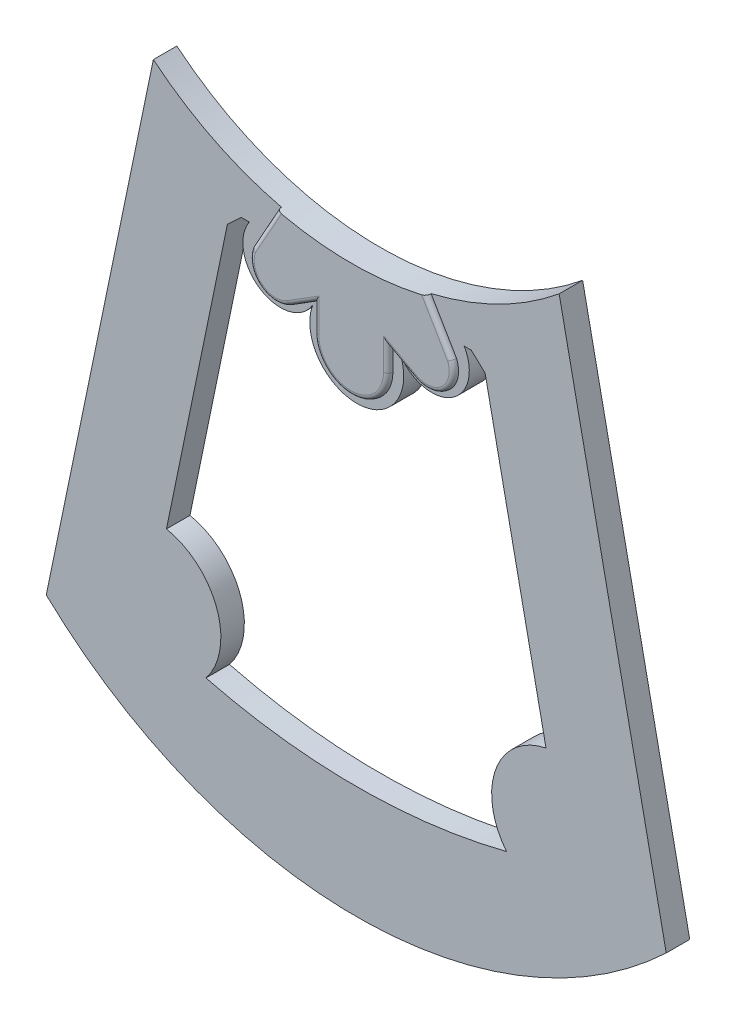
ISO-10303-21;
HEADER;
FILE_DESCRIPTION(('STEP AP214'),'2;1');
FILE_NAME('part.step','',(''),(''),'','','');
FILE_SCHEMA(('AUTOMOTIVE_DESIGN { 1 0 10303 214 1 1 1 1 }'));
ENDSEC;
DATA;
#1=APPLICATION_CONTEXT('core data for automotive mechanical design processes');
#2=APPLICATION_PROTOCOL_DEFINITION('international standard','automotive_design',2000,#1);
#3=PRODUCT_CONTEXT('',#1,'mechanical');
#4=PRODUCT('Part','Part','',(#3));
#5=PRODUCT_RELATED_PRODUCT_CATEGORY('part','',(#4));
#6=PRODUCT_DEFINITION_FORMATION('','',#4);
#7=PRODUCT_DEFINITION_CONTEXT('part definition',#1,'design');
#8=PRODUCT_DEFINITION('design','',#6,#7);
#9=PRODUCT_DEFINITION_SHAPE('','',#8);
#10=(LENGTH_UNIT() NAMED_UNIT(*) SI_UNIT(.MILLI.,.METRE.));
#11=(NAMED_UNIT(*) PLANE_ANGLE_UNIT() SI_UNIT($,.RADIAN.));
#12=(NAMED_UNIT(*) SI_UNIT($,.STERADIAN.) SOLID_ANGLE_UNIT());
#13=UNCERTAINTY_MEASURE_WITH_UNIT(LENGTH_MEASURE(1.E-05),#10,'distance_accuracy_value','');
#14=(GEOMETRIC_REPRESENTATION_CONTEXT(3) GLOBAL_UNCERTAINTY_ASSIGNED_CONTEXT((#13)) GLOBAL_UNIT_ASSIGNED_CONTEXT((#10,
#11,#12)) REPRESENTATION_CONTEXT('',''));
#15=CARTESIAN_POINT('',(0.,0.,0.));
#16=DIRECTION('',(0.,0.,1.));
#17=DIRECTION('',(1.,0.,0.));
#18=AXIS2_PLACEMENT_3D('',#15,#16,#17);
#19=CARTESIAN_POINT('',(65.88125,143.500383662868,0.));
#20=DIRECTION('',(0.,1.,0.));
#21=DIRECTION('',(0.,0.,1.));
#22=AXIS2_PLACEMENT_3D('',#19,#20,#21);
#23=PLANE('',#22);
#24=DIRECTION('',(-1.,0.,0.));
#25=VECTOR('',#24,1.);
#26=CARTESIAN_POINT('',(65.88125,143.500383662868,0.));
#27=LINE('',#26,#25);
#28=CARTESIAN_POINT('',(68.6118408671896,143.500383662868,0.));
#29=VERTEX_POINT('',#28);
#30=CARTESIAN_POINT('',(65.88125,143.500383662868,0.));
#31=VERTEX_POINT('',#30);
#32=EDGE_CURVE('E441',#29,#31,#27,.T.);
#33=ORIENTED_EDGE('',*,*,#32,.F.);
#34=DIRECTION('',(0.,0.,1.));
#35=VECTOR('',#34,1.);
#36=CARTESIAN_POINT('',(68.6118408671896,143.500383662868,0.));
#37=LINE('',#36,#35);
#38=CARTESIAN_POINT('',(68.6118408671896,143.500383662868,7.9375));
#39=VERTEX_POINT('',#38);
#40=EDGE_CURVE('E418',#29,#39,#37,.T.);
#41=ORIENTED_EDGE('',*,*,#40,.T.);
#42=DIRECTION('',(-1.,0.,0.));
#43=VECTOR('',#42,1.);
#44=CARTESIAN_POINT('',(65.88125,143.500383662868,7.9375));
#45=LINE('',#44,#43);
#46=CARTESIAN_POINT('',(65.88125,143.500383662868,7.9375));
#47=VERTEX_POINT('',#46);
#48=EDGE_CURVE('E465',#39,#47,#45,.T.);
#49=ORIENTED_EDGE('',*,*,#48,.T.);
#50=DIRECTION('',(0.,0.,1.));
#51=VECTOR('',#50,1.);
#52=CARTESIAN_POINT('',(65.88125,143.500383662868,0.));
#53=LINE('',#52,#51);
#54=EDGE_CURVE('E474',#31,#47,#53,.T.);
#55=ORIENTED_EDGE('',*,*,#54,.F.);
#56=EDGE_LOOP('',(#33,#41,#49,#55));
#57=FACE_BOUND('',#56,.T.);
#58=ADVANCED_FACE('F32',(#57),#23,.F.);
#59=CARTESIAN_POINT('',(104.775,110.670499117877,7.9375));
#60=DIRECTION('',(0.,0.,-1.));
#61=DIRECTION('',(-1.,0.,0.));
#62=AXIS2_PLACEMENT_3D('',#59,#60,#61);
#63=CYLINDRICAL_SURFACE('',#62,152.4);
#64=CARTESIAN_POINT('',(104.775,110.670499117877,0.));
#65=DIRECTION('',(0.,0.,1.));
#66=DIRECTION('',(1.,0.,0.));
#67=AXIS2_PLACEMENT_3D('',#64,#65,#66);
#68=CIRCLE('',#67,152.4);
#69=CARTESIAN_POINT('',(0.,0.,0.));
#70=VERTEX_POINT('',#69);
#71=CARTESIAN_POINT('',(209.55,0.,0.));
#72=VERTEX_POINT('',#71);
#73=EDGE_CURVE('E327',#70,#72,#68,.T.);
#74=ORIENTED_EDGE('',*,*,#73,.T.);
#75=DIRECTION('',(0.,0.,-1.));
#76=VECTOR('',#75,1.);
#77=CARTESIAN_POINT('',(209.55,0.,7.9375));
#78=LINE('',#77,#76);
#79=CARTESIAN_POINT('',(209.55,0.,7.9375));
#80=VERTEX_POINT('',#79);
#81=EDGE_CURVE('E330',#80,#72,#78,.T.);
#82=ORIENTED_EDGE('',*,*,#81,.F.);
#83=CARTESIAN_POINT('',(104.775,110.670499117877,7.9375));
#84=DIRECTION('',(0.,0.,1.));
#85=DIRECTION('',(1.,0.,0.));
#86=AXIS2_PLACEMENT_3D('',#83,#84,#85);
#87=CIRCLE('',#86,152.4);
#88=CARTESIAN_POINT('',(0.,0.,7.9375));
#89=VERTEX_POINT('',#88);
#90=EDGE_CURVE('E349',#89,#80,#87,.T.);
#91=ORIENTED_EDGE('',*,*,#90,.F.);
#92=DIRECTION('',(0.,0.,-1.));
#93=VECTOR('',#92,1.);
#94=CARTESIAN_POINT('',(0.,0.,7.9375));
#95=LINE('',#94,#93);
#96=EDGE_CURVE('E332',#89,#70,#95,.T.);
#97=ORIENTED_EDGE('',*,*,#96,.T.);
#98=EDGE_LOOP('',(#74,#82,#91,#97));
#99=FACE_BOUND('',#98,.T.);
#100=ADVANCED_FACE('F313',(#99),#63,.T.);
#101=CARTESIAN_POINT('',(173.355,174.85511093188,7.9375));
#102=DIRECTION('',(-0.979240325107693,-0.202702702702703,0.));
#103=DIRECTION('',(0.202702702702703,-0.979240325107693,0.));
#104=AXIS2_PLACEMENT_3D('',#101,#102,#103);
#105=PLANE('',#104);
#106=DIRECTION('',(-0.202702702702703,0.979240325107693,0.));
#107=VECTOR('',#106,1.);
#108=CARTESIAN_POINT('',(173.355,174.85511093188,0.));
#109=LINE('',#108,#107);
#110=CARTESIAN_POINT('',(173.355,174.85511093188,0.));
#111=VERTEX_POINT('',#110);
#112=EDGE_CURVE('E335',#72,#111,#109,.T.);
#113=ORIENTED_EDGE('',*,*,#112,.T.);
#114=DIRECTION('',(0.,0.,-1.));
#115=VECTOR('',#114,1.);
#116=CARTESIAN_POINT('',(173.355,174.85511093188,7.9375));
#117=LINE('',#116,#115);
#118=CARTESIAN_POINT('',(173.355,174.85511093188,7.9375));
#119=VERTEX_POINT('',#118);
#120=EDGE_CURVE('E354',#119,#111,#117,.T.);
#121=ORIENTED_EDGE('',*,*,#120,.F.);
#122=DIRECTION('',(-0.202702702702703,0.979240325107693,0.));
#123=VECTOR('',#122,1.);
#124=CARTESIAN_POINT('',(173.355,174.85511093188,7.9375));
#125=LINE('',#124,#123);
#126=EDGE_CURVE('E489',#80,#119,#125,.T.);
#127=ORIENTED_EDGE('',*,*,#126,.F.);
#128=ORIENTED_EDGE('',*,*,#81,.T.);
#129=EDGE_LOOP('',(#113,#121,#127,#128));
#130=FACE_BOUND('',#129,.T.);
#131=ADVANCED_FACE('F308',(#130),#105,.F.);
#132=CARTESIAN_POINT('',(104.775,258.221687567843,7.9375));
#133=DIRECTION('',(0.,0.,-1.));
#134=DIRECTION('',(-1.,0.,0.));
#135=AXIS2_PLACEMENT_3D('',#132,#133,#134);
#136=CYLINDRICAL_SURFACE('',#135,107.95);
#137=CARTESIAN_POINT('',(104.775,258.221687567843,9.525));
#138=DIRECTION('',(0.,0.,-1.));
#139=DIRECTION('',(1.,0.,0.));
#140=AXIS2_PLACEMENT_3D('',#137,#138,#139);
#141=CIRCLE('',#140,107.95);
#142=CARTESIAN_POINT('',(128.464956033912,152.903177878847,9.525));
#143=VERTEX_POINT('',#142);
#144=CARTESIAN_POINT('',(81.0750113269593,152.905435085628,9.525));
#145=VERTEX_POINT('',#144);
#146=EDGE_CURVE('E372',#143,#145,#141,.T.);
#147=ORIENTED_EDGE('',*,*,#146,.F.);
#148=CARTESIAN_POINT('',(128.464956033912,152.903177878847,9.525));
#149=CARTESIAN_POINT('',(128.512257065107,152.913817418776,9.52499842899379));
#150=CARTESIAN_POINT('',(128.559529041124,152.924484303336,9.52298303885355));
#151=CARTESIAN_POINT('',(128.653734599847,152.945807796816,9.5149291707803));
#152=CARTESIAN_POINT('',(128.700668158561,152.956464404962,9.50889041041388));
#153=CARTESIAN_POINT('',(128.840519657881,152.988316576372,9.48474823848041));
#154=CARTESIAN_POINT('',(128.932499799481,153.009397046763,9.46061893336153));
#155=CARTESIAN_POINT('',(129.111174705765,153.050581564774,9.39673281551979));
#156=CARTESIAN_POINT('',(129.197863705447,153.070684542678,9.35695929665416));
#157=CARTESIAN_POINT('',(129.363191988118,153.109221536108,9.26266770863809));
#158=CARTESIAN_POINT('',(129.441836413642,153.127656616964,9.20815914116603));
#159=CARTESIAN_POINT('',(129.586603505975,153.161741668138,9.08731915775392));
#160=CARTESIAN_POINT('',(129.652997147604,153.177451280018,9.02132950817525));
#161=CARTESIAN_POINT('',(129.773442361471,153.206049577169,8.87833409866643));
#162=CARTESIAN_POINT('',(129.827492968767,153.218938041887,8.80132747822615));
#163=CARTESIAN_POINT('',(129.919140101257,153.240847182251,8.64220318473147));
#164=CARTESIAN_POINT('',(129.957360884264,153.250014238292,8.56046450633683));
#165=CARTESIAN_POINT('',(130.019273434084,153.264886050601,8.39141064751719));
#166=CARTESIAN_POINT('',(130.042983315317,153.270595123488,8.30410257059086));
#167=CARTESIAN_POINT('',(130.067288918528,153.276450961431,8.16957049019439));
#168=CARTESIAN_POINT('',(130.073517528922,153.27795245816,8.12335473190504));
#169=CARTESIAN_POINT('',(130.081823068316,153.279955092991,8.03060060811351));
#170=CARTESIAN_POINT('',(130.083906248096,153.280457737234,7.98406283467119));
#171=CARTESIAN_POINT('',(130.083904991818,153.280457214302,7.9375));
#172=B_SPLINE_CURVE_WITH_KNOTS('',3,(#148,#149,#150,#151,#152,#153,#154,#155,#156,#157,#158,
#159,#160,#161,#162,#163,#164,#165,#166,#167,#168,#169,#170,#171),.UNSPECIFIED.,.F.,.F.,(4,2,2,
2,2,2,2,2,2,2,2,4),(0.,0.145361710983565,0.290733627175156,0.581442908473752,0.872463478930361,
1.16329683488025,1.44661767370815,1.72996065416598,2.00071713318835,2.27113492519674,
2.41093579907413,2.55052571084334),.UNSPECIFIED.);
#173=CARTESIAN_POINT('',(130.083904991818,153.280457214302,7.9375));
#174=VERTEX_POINT('',#173);
#175=EDGE_CURVE('E11',#143,#174,#172,.T.);
#176=ORIENTED_EDGE('',*,*,#175,.T.);
#177=CARTESIAN_POINT('',(104.775,258.221687567843,7.9375));
#178=DIRECTION('',(0.,0.,-1.));
#179=DIRECTION('',(1.,0.,0.));
#180=AXIS2_PLACEMENT_3D('',#177,#178,#179);
#181=CIRCLE('',#180,107.95);
#182=EDGE_CURVE('E491',#119,#174,#181,.T.);
#183=ORIENTED_EDGE('',*,*,#182,.F.);
#184=ORIENTED_EDGE('',*,*,#120,.T.);
#185=CARTESIAN_POINT('',(104.775,258.221687567843,0.));
#186=DIRECTION('',(0.,0.,-1.));
#187=DIRECTION('',(1.,0.,0.));
#188=AXIS2_PLACEMENT_3D('',#185,#186,#187);
#189=CIRCLE('',#188,107.95);
#190=CARTESIAN_POINT('',(36.195,174.85511093188,0.));
#191=VERTEX_POINT('',#190);
#192=EDGE_CURVE('E338',#111,#191,#189,.T.);
#193=ORIENTED_EDGE('',*,*,#192,.T.);
#194=DIRECTION('',(0.,0.,-1.));
#195=VECTOR('',#194,1.);
#196=CARTESIAN_POINT('',(36.195,174.85511093188,7.9375));
#197=LINE('',#196,#195);
#198=CARTESIAN_POINT('',(36.195,174.85511093188,7.9375));
#199=VERTEX_POINT('',#198);
#200=EDGE_CURVE('E351',#199,#191,#197,.T.);
#201=ORIENTED_EDGE('',*,*,#200,.F.);
#202=CARTESIAN_POINT('',(79.4660950081821,153.280457214302,7.9375));
#203=VERTEX_POINT('',#202);
#204=EDGE_CURVE('E490',#203,#199,#181,.T.);
#205=ORIENTED_EDGE('',*,*,#204,.F.);
#206=CARTESIAN_POINT('',(79.4660950081821,153.280457214302,7.9375));
#207=CARTESIAN_POINT('',(79.4660945345376,153.280457487844,7.98094858047463));
#208=CARTESIAN_POINT('',(79.4678968005009,153.280022654825,8.02437593274889));
#209=CARTESIAN_POINT('',(79.4750816010233,153.278290208827,8.11091096082904));
#210=CARTESIAN_POINT('',(79.4804637102826,153.276992698339,8.15401867399428));
#211=CARTESIAN_POINT('',(79.5019049890907,153.27182621451,8.2822369784127));
#212=CARTESIAN_POINT('',(79.5232594191852,153.266683200799,8.36647406186022));
#213=CARTESIAN_POINT('',(79.5793799992276,153.253196798331,8.53003804359265));
#214=CARTESIAN_POINT('',(79.6141479714913,153.244852974724,8.60936427300649));
#215=CARTESIAN_POINT('',(79.6959665260973,153.225276472643,8.76102518444456));
#216=CARTESIAN_POINT('',(79.7430183768595,153.21404349584,8.83335914339694));
#217=CARTESIAN_POINT('',(79.8487481807475,153.188895266968,8.97022799977702));
#218=CARTESIAN_POINT('',(79.9075925598727,153.1749417064,9.03462707019403));
#219=CARTESIAN_POINT('',(80.0346821783632,153.144937374344,9.15278523021685));
#220=CARTESIAN_POINT('',(80.1029295682379,153.128886123148,9.20654187898131));
#221=CARTESIAN_POINT('',(80.249445070666,153.094595412971,9.30391254797651));
#222=CARTESIAN_POINT('',(80.3279817891721,153.076298728424,9.34710177055125));
#223=CARTESIAN_POINT('',(80.4908696789535,153.038559171059,9.41987404938997));
#224=CARTESIAN_POINT('',(80.5752208141407,153.019116305353,9.44945719009389));
#225=CARTESIAN_POINT('',(80.7288644684674,152.983906046077,9.48958945141232));
#226=CARTESIAN_POINT('',(80.7974855058794,152.968249370849,9.50286635589049));
#227=CARTESIAN_POINT('',(80.9357315101706,152.936850705773,9.52057180276624));
#228=CARTESIAN_POINT('',(81.0053548225333,152.921108878492,9.52501354577508));
#229=CARTESIAN_POINT('',(81.0750113269593,152.905435085628,9.525));
#230=B_SPLINE_CURVE_WITH_KNOTS('',3,(#206,#207,#208,#209,#210,#211,#212,#213,#214,#215,#216,
#217,#218,#219,#220,#221,#222,#223,#224,#225,#226,#227,#228,#229),.UNSPECIFIED.,.F.,.F.,(4,2,2,
2,2,2,2,2,2,2,2,4),(0.,0.130264260014154,0.260513046871119,0.520325625207415,0.780173513187151,
1.04004824339895,1.3038878594066,1.56778791715433,1.84099942904869,2.11420924535753,
2.32855099800317,2.54257226144784),.UNSPECIFIED.);
#231=EDGE_CURVE('E46',#203,#145,#230,.T.);
#232=ORIENTED_EDGE('',*,*,#231,.T.);
#233=EDGE_LOOP('',(#147,#176,#183,#184,#193,#201,#205,#232));
#234=FACE_BOUND('',#233,.T.);
#235=ADVANCED_FACE('F302',(#234),#136,.F.);
#236=CARTESIAN_POINT('',(0.,0.,7.9375));
#237=DIRECTION('',(0.979240325107693,-0.202702702702703,0.));
#238=DIRECTION('',(0.202702702702703,0.979240325107693,0.));
#239=AXIS2_PLACEMENT_3D('',#236,#237,#238);
#240=PLANE('',#239);
#241=DIRECTION('',(-0.202702702702703,-0.979240325107693,0.));
#242=VECTOR('',#241,1.);
#243=CARTESIAN_POINT('',(0.,0.,0.));
#244=LINE('',#243,#242);
#245=EDGE_CURVE('E347',#191,#70,#244,.T.);
#246=ORIENTED_EDGE('',*,*,#245,.T.);
#247=ORIENTED_EDGE('',*,*,#96,.F.);
#248=DIRECTION('',(-0.202702702702703,-0.979240325107693,0.));
#249=VECTOR('',#248,1.);
#250=CARTESIAN_POINT('',(0.,0.,7.9375));
#251=LINE('',#250,#249);
#252=EDGE_CURVE('E343',#199,#89,#251,.T.);
#253=ORIENTED_EDGE('',*,*,#252,.F.);
#254=ORIENTED_EDGE('',*,*,#200,.T.);
#255=EDGE_LOOP('',(#246,#247,#253,#254));
#256=FACE_BOUND('',#255,.T.);
#257=ADVANCED_FACE('F307',(#256),#240,.F.);
#258=CARTESIAN_POINT('',(104.775,110.670499117877,7.9375));
#259=DIRECTION('',(0.,0.,1.));
#260=DIRECTION('',(1.,0.,0.));
#261=AXIS2_PLACEMENT_3D('',#258,#259,#260);
#262=PLANE('',#261);
#263=DIRECTION('',(-0.505652147530801,0.862737448878562,0.));
#264=VECTOR('',#263,1.);
#265=CARTESIAN_POINT('',(138.657255170699,138.652713027336,7.9375));
#266=LINE('',#265,#264);
#267=CARTESIAN_POINT('',(138.657255170699,138.652713027336,7.9375));
#268=VERTEX_POINT('',#267);
#269=EDGE_CURVE('E376',#268,#174,#266,.T.);
#270=ORIENTED_EDGE('',*,*,#269,.F.);
#271=CARTESIAN_POINT('',(130.207247306887,135.141831850332,7.9375));
#272=DIRECTION('',(0.,0.,1.));
#273=DIRECTION('',(1.,0.,0.));
#274=AXIS2_PLACEMENT_3D('',#271,#272,#273);
#275=CIRCLE('',#274,9.15035078767626);
#276=CARTESIAN_POINT('',(125.809979084313,127.117309950788,7.9375));
#277=VERTEX_POINT('',#276);
#278=EDGE_CURVE('E382',#277,#268,#275,.T.);
#279=ORIENTED_EDGE('',*,*,#278,.F.);
#280=DIRECTION('',(0.876963308374144,-0.480557338686525,0.));
#281=VECTOR('',#280,1.);
#282=CARTESIAN_POINT('',(117.162311803682,131.856048658033,7.9375));
#283=LINE('',#282,#281);
#284=CARTESIAN_POINT('',(117.162311803682,131.856048658033,7.9375));
#285=VERTEX_POINT('',#284);
#286=EDGE_CURVE('E395',#285,#277,#283,.T.);
#287=ORIENTED_EDGE('',*,*,#286,.F.);
#288=DIRECTION('',(0.,1.,0.));
#289=VECTOR('',#288,1.);
#290=CARTESIAN_POINT('',(117.162311803682,123.836556770023,7.9375));
#291=LINE('',#290,#289);
#292=CARTESIAN_POINT('',(117.162311803682,123.836556770023,7.9375));
#293=VERTEX_POINT('',#292);
#294=EDGE_CURVE('E392',#293,#285,#291,.T.);
#295=ORIENTED_EDGE('',*,*,#294,.F.);
#296=CARTESIAN_POINT('',(104.636462236003,123.836556770023,7.9375));
#297=DIRECTION('',(0.,0.,1.));
#298=DIRECTION('',(1.,0.,0.));
#299=AXIS2_PLACEMENT_3D('',#296,#297,#298);
#300=CIRCLE('',#299,12.5258495676792);
#301=CARTESIAN_POINT('',(92.1106126683234,123.836556770023,7.9375));
#302=VERTEX_POINT('',#301);
#303=EDGE_CURVE('E389',#302,#293,#300,.T.);
#304=ORIENTED_EDGE('',*,*,#303,.F.);
#305=DIRECTION('',(0.,-1.,0.));
#306=VECTOR('',#305,1.);
#307=CARTESIAN_POINT('',(92.1106126683234,132.311409740972,7.9375));
#308=LINE('',#307,#306);
#309=CARTESIAN_POINT('',(92.1106126683234,132.311409740972,7.9375));
#310=VERTEX_POINT('',#309);
#311=EDGE_CURVE('E386',#310,#302,#308,.T.);
#312=ORIENTED_EDGE('',*,*,#311,.F.);
#313=DIRECTION('',(0.847754771245418,0.530388393378503,0.));
#314=VECTOR('',#313,1.);
#315=CARTESIAN_POINT('',(92.1106126683234,132.311409740972,7.9375));
#316=LINE('',#315,#314);
#317=CARTESIAN_POINT('',(83.8643676231442,127.152237761919,7.9375));
#318=VERTEX_POINT('',#317);
#319=EDGE_CURVE('E217',#318,#310,#316,.T.);
#320=ORIENTED_EDGE('',*,*,#319,.F.);
#321=CARTESIAN_POINT('',(79.151975634031,134.684364864667,7.9375));
#322=DIRECTION('',(0.,0.,1.));
#323=DIRECTION('',(-1.,0.,0.));
#324=AXIS2_PLACEMENT_3D('',#321,#322,#323);
#325=CIRCLE('',#324,8.88479470505741);
#326=CARTESIAN_POINT('',(70.8596017422812,137.874366775394,7.9375));
#327=VERTEX_POINT('',#326);
#328=EDGE_CURVE('E210',#327,#318,#325,.T.);
#329=ORIENTED_EDGE('',*,*,#328,.F.);
#330=DIRECTION('',(-0.487700765271342,-0.873010861074333,0.));
#331=VECTOR('',#330,1.);
#332=CARTESIAN_POINT('',(79.4660950081821,153.280457214302,7.9375));
#333=LINE('',#332,#331);
#334=EDGE_CURVE('E214',#203,#327,#333,.T.);
#335=ORIENTED_EDGE('',*,*,#334,.F.);
#336=ORIENTED_EDGE('',*,*,#204,.T.);
#337=ORIENTED_EDGE('',*,*,#252,.T.);
#338=ORIENTED_EDGE('',*,*,#90,.T.);
#339=ORIENTED_EDGE('',*,*,#126,.T.);
#340=ORIENTED_EDGE('',*,*,#182,.T.);
#341=EDGE_LOOP('',(#270,#279,#287,#295,#304,#312,#320,#329,#335,#336,#337,#338,#339,#340));
#342=FACE_BOUND('',#341,.T.);
#343=ORIENTED_EDGE('',*,*,#48,.F.);
#344=CARTESIAN_POINT('',(79.1561005992414,136.421641775849,7.9375));
#345=DIRECTION('',(0.,0.,1.));
#346=DIRECTION('',(1.,0.,0.));
#347=AXIS2_PLACEMENT_3D('',#344,#345,#346);
#348=CIRCLE('',#347,12.7);
#349=CARTESIAN_POINT('',(90.0089109745047,129.825695523902,7.9375));
#350=VERTEX_POINT('',#349);
#351=EDGE_CURVE('E404',#39,#350,#348,.T.);
#352=ORIENTED_EDGE('',*,*,#351,.T.);
#353=CARTESIAN_POINT('',(104.946167998357,124.450383662868,7.9375));
#354=DIRECTION('',(0.,0.,1.));
#355=DIRECTION('',(1.,0.,0.));
#356=AXIS2_PLACEMENT_3D('',#353,#354,#355);
#357=CIRCLE('',#356,15.875);
#358=CARTESIAN_POINT('',(119.883425022209,129.825695523902,7.9375));
#359=VERTEX_POINT('',#358);
#360=EDGE_CURVE('E375',#350,#359,#357,.T.);
#361=ORIENTED_EDGE('',*,*,#360,.T.);
#362=CARTESIAN_POINT('',(130.283850707261,137.114120975926,7.9375));
#363=DIRECTION('',(0.,0.,1.));
#364=DIRECTION('',(1.,0.,0.));
#365=AXIS2_PLACEMENT_3D('',#362,#363,#364);
#366=CIRCLE('',#365,12.7);
#367=CARTESIAN_POINT('',(141.261357204339,143.500383662868,7.9375));
#368=VERTEX_POINT('',#367);
#369=EDGE_CURVE('E379',#359,#368,#366,.T.);
#370=ORIENTED_EDGE('',*,*,#369,.T.);
#371=CARTESIAN_POINT('',(143.66875,143.500383662868,7.9375));
#372=VERTEX_POINT('',#371);
#373=EDGE_CURVE('E466',#372,#368,#45,.T.);
#374=ORIENTED_EDGE('',*,*,#373,.F.);
#375=DIRECTION('',(-0.732119152889858,0.681176589418512,0.));
#376=VECTOR('',#375,1.);
#377=CARTESIAN_POINT('',(148.317706620851,139.17491232006,7.9375));
#378=LINE('',#377,#376);
#379=CARTESIAN_POINT('',(148.317706620851,139.17491232006,7.9375));
#380=VERTEX_POINT('',#379);
#381=EDGE_CURVE('E462',#380,#372,#378,.T.);
#382=ORIENTED_EDGE('',*,*,#381,.F.);
#383=DIRECTION('',(-0.202702702702703,0.979240325107693,0.));
#384=VECTOR('',#383,1.);
#385=CARTESIAN_POINT('',(168.912301215445,39.6840952891184,7.9375));
#386=LINE('',#385,#384);
#387=CARTESIAN_POINT('',(168.912301215445,39.6840952891184,7.9375));
#388=VERTEX_POINT('',#387);
#389=EDGE_CURVE('E459',#388,#380,#386,.T.);
#390=ORIENTED_EDGE('',*,*,#389,.F.);
#391=CARTESIAN_POINT('',(173.585130717299,17.110034758317,7.9375));
#392=DIRECTION('',(0.,0.,-1.));
#393=DIRECTION('',(-1.,0.,0.));
#394=AXIS2_PLACEMENT_3D('',#391,#392,#393);
#395=CIRCLE('',#394,23.0526255424774);
#396=CARTESIAN_POINT('',(155.575,2.72049911787692,7.9375));
#397=VERTEX_POINT('',#396);
#398=EDGE_CURVE('E456',#397,#388,#395,.T.);
#399=ORIENTED_EDGE('',*,*,#398,.F.);
#400=CARTESIAN_POINT('',(104.775,202.745499117877,7.9375));
#401=DIRECTION('',(0.,0.,1.));
#402=DIRECTION('',(1.,0.,0.));
#403=AXIS2_PLACEMENT_3D('',#400,#401,#402);
#404=CIRCLE('',#403,206.375);
#405=CARTESIAN_POINT('',(53.9749999999998,2.720499117877,7.9375));
#406=VERTEX_POINT('',#405);
#407=EDGE_CURVE('E453',#406,#397,#404,.T.);
#408=ORIENTED_EDGE('',*,*,#407,.F.);
#409=CARTESIAN_POINT('',(35.9648692827013,17.110034758317,7.9375));
#410=DIRECTION('',(0.,0.,-1.));
#411=DIRECTION('',(-1.,0.,0.));
#412=AXIS2_PLACEMENT_3D('',#409,#410,#411);
#413=CIRCLE('',#412,23.0526255424774);
#414=CARTESIAN_POINT('',(40.6376987845548,39.6840952891184,7.9375));
#415=VERTEX_POINT('',#414);
#416=EDGE_CURVE('E417',#415,#406,#413,.T.);
#417=ORIENTED_EDGE('',*,*,#416,.F.);
#418=DIRECTION('',(-0.202702702702702,-0.979240325107693,0.));
#419=VECTOR('',#418,1.);
#420=CARTESIAN_POINT('',(40.6376987845548,39.6840952891184,7.9375));
#421=LINE('',#420,#419);
#422=CARTESIAN_POINT('',(61.2322933791493,139.17491232006,7.9375));
#423=VERTEX_POINT('',#422);
#424=EDGE_CURVE('E429',#423,#415,#421,.T.);
#425=ORIENTED_EDGE('',*,*,#424,.F.);
#426=DIRECTION('',(-0.732119152889865,-0.681176589418505,0.));
#427=VECTOR('',#426,1.);
#428=CARTESIAN_POINT('',(61.2322933791493,139.17491232006,7.9375));
#429=LINE('',#428,#427);
#430=EDGE_CURVE('E468',#47,#423,#429,.T.);
#431=ORIENTED_EDGE('',*,*,#430,.F.);
#432=EDGE_LOOP('',(#343,#352,#361,#370,#374,#382,#390,#399,#408,#417,#425,#431));
#433=FACE_BOUND('',#432,.T.);
#434=ADVANCED_FACE('F212',(#342,#433),#262,.T.);
#435=CARTESIAN_POINT('',(104.775,110.670499117877,0.));
#436=DIRECTION('',(0.,0.,1.));
#437=DIRECTION('',(1.,0.,0.));
#438=AXIS2_PLACEMENT_3D('',#435,#436,#437);
#439=PLANE('',#438);
#440=CARTESIAN_POINT('',(79.1561005992414,136.421641775849,0.));
#441=DIRECTION('',(0.,0.,1.));
#442=DIRECTION('',(1.,0.,0.));
#443=AXIS2_PLACEMENT_3D('',#440,#441,#442);
#444=CIRCLE('',#443,12.7);
#445=CARTESIAN_POINT('',(90.0089109745047,129.825695523902,0.));
#446=VERTEX_POINT('',#445);
#447=EDGE_CURVE('E407',#29,#446,#444,.T.);
#448=ORIENTED_EDGE('',*,*,#447,.F.);
#449=ORIENTED_EDGE('',*,*,#32,.T.);
#450=DIRECTION('',(-0.732119152889865,-0.681176589418505,0.));
#451=VECTOR('',#450,1.);
#452=CARTESIAN_POINT('',(61.2322933791493,139.17491232006,0.));
#453=LINE('',#452,#451);
#454=CARTESIAN_POINT('',(61.2322933791493,139.17491232006,0.));
#455=VERTEX_POINT('',#454);
#456=EDGE_CURVE('E445',#31,#455,#453,.T.);
#457=ORIENTED_EDGE('',*,*,#456,.T.);
#458=DIRECTION('',(-0.202702702702702,-0.979240325107693,0.));
#459=VECTOR('',#458,1.);
#460=CARTESIAN_POINT('',(40.6376987845548,39.6840952891184,0.));
#461=LINE('',#460,#459);
#462=CARTESIAN_POINT('',(40.6376987845548,39.6840952891184,0.));
#463=VERTEX_POINT('',#462);
#464=EDGE_CURVE('E448',#455,#463,#461,.T.);
#465=ORIENTED_EDGE('',*,*,#464,.T.);
#466=CARTESIAN_POINT('',(35.9648692827013,17.110034758317,0.));
#467=DIRECTION('',(0.,0.,-1.));
#468=DIRECTION('',(-1.,0.,0.));
#469=AXIS2_PLACEMENT_3D('',#466,#467,#468);
#470=CIRCLE('',#469,23.0526255424774);
#471=CARTESIAN_POINT('',(53.9749999999998,2.720499117877,0.));
#472=VERTEX_POINT('',#471);
#473=EDGE_CURVE('E425',#463,#472,#470,.T.);
#474=ORIENTED_EDGE('',*,*,#473,.T.);
#475=CARTESIAN_POINT('',(104.775,202.745499117877,0.));
#476=DIRECTION('',(0.,0.,1.));
#477=DIRECTION('',(1.,0.,0.));
#478=AXIS2_PLACEMENT_3D('',#475,#476,#477);
#479=CIRCLE('',#478,206.375);
#480=CARTESIAN_POINT('',(155.575,2.72049911787692,0.));
#481=VERTEX_POINT('',#480);
#482=EDGE_CURVE('E428',#472,#481,#479,.T.);
#483=ORIENTED_EDGE('',*,*,#482,.T.);
#484=CARTESIAN_POINT('',(173.585130717299,17.110034758317,0.));
#485=DIRECTION('',(0.,0.,-1.));
#486=DIRECTION('',(-1.,0.,0.));
#487=AXIS2_PLACEMENT_3D('',#484,#485,#486);
#488=CIRCLE('',#487,23.0526255424774);
#489=CARTESIAN_POINT('',(168.912301215445,39.6840952891184,0.));
#490=VERTEX_POINT('',#489);
#491=EDGE_CURVE('E432',#481,#490,#488,.T.);
#492=ORIENTED_EDGE('',*,*,#491,.T.);
#493=DIRECTION('',(-0.202702702702703,0.979240325107693,0.));
#494=VECTOR('',#493,1.);
#495=CARTESIAN_POINT('',(168.912301215445,39.6840952891184,0.));
#496=LINE('',#495,#494);
#497=CARTESIAN_POINT('',(148.317706620851,139.17491232006,0.));
#498=VERTEX_POINT('',#497);
#499=EDGE_CURVE('E435',#490,#498,#496,.T.);
#500=ORIENTED_EDGE('',*,*,#499,.T.);
#501=DIRECTION('',(-0.732119152889858,0.681176589418512,0.));
#502=VECTOR('',#501,1.);
#503=CARTESIAN_POINT('',(148.317706620851,139.17491232006,0.));
#504=LINE('',#503,#502);
#505=CARTESIAN_POINT('',(143.66875,143.500383662868,0.));
#506=VERTEX_POINT('',#505);
#507=EDGE_CURVE('E438',#498,#506,#504,.T.);
#508=ORIENTED_EDGE('',*,*,#507,.T.);
#509=CARTESIAN_POINT('',(141.261357204339,143.500383662868,0.));
#510=VERTEX_POINT('',#509);
#511=EDGE_CURVE('E442',#506,#510,#27,.T.);
#512=ORIENTED_EDGE('',*,*,#511,.T.);
#513=CARTESIAN_POINT('',(130.283850707261,137.114120975926,0.));
#514=DIRECTION('',(0.,0.,1.));
#515=DIRECTION('',(1.,0.,0.));
#516=AXIS2_PLACEMENT_3D('',#513,#514,#515);
#517=CIRCLE('',#516,12.7);
#518=CARTESIAN_POINT('',(119.883425022209,129.825695523902,0.));
#519=VERTEX_POINT('',#518);
#520=EDGE_CURVE('E403',#519,#510,#517,.T.);
#521=ORIENTED_EDGE('',*,*,#520,.F.);
#522=CARTESIAN_POINT('',(104.946167998357,124.450383662868,0.));
#523=DIRECTION('',(0.,0.,1.));
#524=DIRECTION('',(1.,0.,0.));
#525=AXIS2_PLACEMENT_3D('',#522,#523,#524);
#526=CIRCLE('',#525,15.875);
#527=EDGE_CURVE('E400',#446,#519,#526,.T.);
#528=ORIENTED_EDGE('',*,*,#527,.F.);
#529=EDGE_LOOP('',(#448,#449,#457,#465,#474,#483,#492,#500,#508,#512,#521,#528));
#530=FACE_BOUND('',#529,.T.);
#531=ORIENTED_EDGE('',*,*,#73,.F.);
#532=ORIENTED_EDGE('',*,*,#245,.F.);
#533=ORIENTED_EDGE('',*,*,#192,.F.);
#534=ORIENTED_EDGE('',*,*,#112,.F.);
#535=EDGE_LOOP('',(#531,#532,#533,#534));
#536=FACE_BOUND('',#535,.T.);
#537=ADVANCED_FACE('F497',(#530,#536),#439,.F.);
#538=CARTESIAN_POINT('',(35.9648692827013,17.110034758317,0.));
#539=DIRECTION('',(0.,0.,1.));
#540=DIRECTION('',(1.,0.,0.));
#541=AXIS2_PLACEMENT_3D('',#538,#539,#540);
#542=CYLINDRICAL_SURFACE('',#541,23.0526255424774);
#543=ORIENTED_EDGE('',*,*,#416,.T.);
#544=DIRECTION('',(0.,0.,1.));
#545=VECTOR('',#544,1.);
#546=CARTESIAN_POINT('',(53.9749999999998,2.720499117877,0.));
#547=LINE('',#546,#545);
#548=EDGE_CURVE('E451',#472,#406,#547,.T.);
#549=ORIENTED_EDGE('',*,*,#548,.F.);
#550=ORIENTED_EDGE('',*,*,#473,.F.);
#551=DIRECTION('',(0.,0.,1.));
#552=VECTOR('',#551,1.);
#553=CARTESIAN_POINT('',(40.6376987845548,39.6840952891184,0.));
#554=LINE('',#553,#552);
#555=EDGE_CURVE('E336',#463,#415,#554,.T.);
#556=ORIENTED_EDGE('',*,*,#555,.T.);
#557=EDGE_LOOP('',(#543,#549,#550,#556));
#558=FACE_BOUND('',#557,.T.);
#559=ADVANCED_FACE('F499',(#558),#542,.T.);
#560=CARTESIAN_POINT('',(40.6376987845548,39.6840952891184,0.));
#561=DIRECTION('',(-0.979240325107693,0.202702702702702,0.));
#562=DIRECTION('',(-0.202702702702702,-0.979240325107693,0.));
#563=AXIS2_PLACEMENT_3D('',#560,#561,#562);
#564=PLANE('',#563);
#565=ORIENTED_EDGE('',*,*,#424,.T.);
#566=ORIENTED_EDGE('',*,*,#555,.F.);
#567=ORIENTED_EDGE('',*,*,#464,.F.);
#568=DIRECTION('',(0.,0.,1.));
#569=VECTOR('',#568,1.);
#570=CARTESIAN_POINT('',(61.2322933791493,139.17491232006,0.));
#571=LINE('',#570,#569);
#572=EDGE_CURVE('E340',#455,#423,#571,.T.);
#573=ORIENTED_EDGE('',*,*,#572,.T.);
#574=EDGE_LOOP('',(#565,#566,#567,#573));
#575=FACE_BOUND('',#574,.T.);
#576=ADVANCED_FACE('F505',(#575),#564,.F.);
#577=CARTESIAN_POINT('',(61.2322933791493,139.17491232006,0.));
#578=DIRECTION('',(-0.681176589418505,0.732119152889865,0.));
#579=DIRECTION('',(-0.732119152889865,-0.681176589418505,0.));
#580=AXIS2_PLACEMENT_3D('',#577,#578,#579);
#581=PLANE('',#580);
#582=ORIENTED_EDGE('',*,*,#430,.T.);
#583=ORIENTED_EDGE('',*,*,#572,.F.);
#584=ORIENTED_EDGE('',*,*,#456,.F.);
#585=ORIENTED_EDGE('',*,*,#54,.T.);
#586=EDGE_LOOP('',(#582,#583,#584,#585));
#587=FACE_BOUND('',#586,.T.);
#588=ADVANCED_FACE('F529',(#587),#581,.F.);
#589=ORIENTED_EDGE('',*,*,#373,.T.);
#590=DIRECTION('',(0.,0.,1.));
#591=VECTOR('',#590,1.);
#592=CARTESIAN_POINT('',(141.261357204339,143.500383662868,0.));
#593=LINE('',#592,#591);
#594=EDGE_CURVE('E421',#510,#368,#593,.T.);
#595=ORIENTED_EDGE('',*,*,#594,.F.);
#596=ORIENTED_EDGE('',*,*,#511,.F.);
#597=DIRECTION('',(0.,0.,1.));
#598=VECTOR('',#597,1.);
#599=CARTESIAN_POINT('',(143.66875,143.500383662868,0.));
#600=LINE('',#599,#598);
#601=EDGE_CURVE('E477',#506,#372,#600,.T.);
#602=ORIENTED_EDGE('',*,*,#601,.T.);
#603=EDGE_LOOP('',(#589,#595,#596,#602));
#604=FACE_BOUND('',#603,.T.);
#605=ADVANCED_FACE('F322',(#604),#23,.F.);
#606=CARTESIAN_POINT('',(148.317706620851,139.17491232006,0.));
#607=DIRECTION('',(0.681176589418512,0.732119152889858,0.));
#608=DIRECTION('',(-0.732119152889858,0.681176589418512,0.));
#609=AXIS2_PLACEMENT_3D('',#606,#607,#608);
#610=PLANE('',#609);
#611=ORIENTED_EDGE('',*,*,#381,.T.);
#612=ORIENTED_EDGE('',*,*,#601,.F.);
#613=ORIENTED_EDGE('',*,*,#507,.F.);
#614=DIRECTION('',(0.,0.,1.));
#615=VECTOR('',#614,1.);
#616=CARTESIAN_POINT('',(148.317706620851,139.17491232006,0.));
#617=LINE('',#616,#615);
#618=EDGE_CURVE('E479',#498,#380,#617,.T.);
#619=ORIENTED_EDGE('',*,*,#618,.T.);
#620=EDGE_LOOP('',(#611,#612,#613,#619));
#621=FACE_BOUND('',#620,.T.);
#622=ADVANCED_FACE('F523',(#621),#610,.F.);
#623=CARTESIAN_POINT('',(168.912301215445,39.6840952891184,0.));
#624=DIRECTION('',(0.979240325107693,0.202702702702703,0.));
#625=DIRECTION('',(-0.202702702702703,0.979240325107693,0.));
#626=AXIS2_PLACEMENT_3D('',#623,#624,#625);
#627=PLANE('',#626);
#628=ORIENTED_EDGE('',*,*,#389,.T.);
#629=ORIENTED_EDGE('',*,*,#618,.F.);
#630=ORIENTED_EDGE('',*,*,#499,.F.);
#631=DIRECTION('',(0.,0.,1.));
#632=VECTOR('',#631,1.);
#633=CARTESIAN_POINT('',(168.912301215445,39.6840952891184,0.));
#634=LINE('',#633,#632);
#635=EDGE_CURVE('E481',#490,#388,#634,.T.);
#636=ORIENTED_EDGE('',*,*,#635,.T.);
#637=EDGE_LOOP('',(#628,#629,#630,#636));
#638=FACE_BOUND('',#637,.T.);
#639=ADVANCED_FACE('F519',(#638),#627,.F.);
#640=CARTESIAN_POINT('',(173.585130717299,17.110034758317,0.));
#641=DIRECTION('',(0.,0.,1.));
#642=DIRECTION('',(1.,0.,0.));
#643=AXIS2_PLACEMENT_3D('',#640,#641,#642);
#644=CYLINDRICAL_SURFACE('',#643,23.0526255424774);
#645=ORIENTED_EDGE('',*,*,#398,.T.);
#646=ORIENTED_EDGE('',*,*,#635,.F.);
#647=ORIENTED_EDGE('',*,*,#491,.F.);
#648=DIRECTION('',(0.,0.,1.));
#649=VECTOR('',#648,1.);
#650=CARTESIAN_POINT('',(155.575,2.72049911787692,0.));
#651=LINE('',#650,#649);
#652=EDGE_CURVE('E483',#481,#397,#651,.T.);
#653=ORIENTED_EDGE('',*,*,#652,.T.);
#654=EDGE_LOOP('',(#645,#646,#647,#653));
#655=FACE_BOUND('',#654,.T.);
#656=ADVANCED_FACE('F515',(#655),#644,.T.);
#657=CARTESIAN_POINT('',(104.775,202.745499117877,0.));
#658=DIRECTION('',(0.,0.,1.));
#659=DIRECTION('',(1.,0.,0.));
#660=AXIS2_PLACEMENT_3D('',#657,#658,#659);
#661=CYLINDRICAL_SURFACE('',#660,206.375);
#662=ORIENTED_EDGE('',*,*,#407,.T.);
#663=ORIENTED_EDGE('',*,*,#652,.F.);
#664=ORIENTED_EDGE('',*,*,#482,.F.);
#665=ORIENTED_EDGE('',*,*,#548,.T.);
#666=EDGE_LOOP('',(#662,#663,#664,#665));
#667=FACE_BOUND('',#666,.T.);
#668=ADVANCED_FACE('F511',(#667),#661,.F.);
#669=CARTESIAN_POINT('',(104.946167998357,124.450383662868,0.));
#670=DIRECTION('',(0.,0.,1.));
#671=DIRECTION('',(1.,0.,0.));
#672=AXIS2_PLACEMENT_3D('',#669,#670,#671);
#673=CYLINDRICAL_SURFACE('',#672,15.875);
#674=ORIENTED_EDGE('',*,*,#360,.F.);
#675=DIRECTION('',(0.,0.,1.));
#676=VECTOR('',#675,1.);
#677=CARTESIAN_POINT('',(90.0089109745047,129.825695523902,0.));
#678=LINE('',#677,#676);
#679=EDGE_CURVE('E415',#446,#350,#678,.T.);
#680=ORIENTED_EDGE('',*,*,#679,.F.);
#681=ORIENTED_EDGE('',*,*,#527,.T.);
#682=DIRECTION('',(0.,0.,1.));
#683=VECTOR('',#682,1.);
#684=CARTESIAN_POINT('',(119.883425022209,129.825695523902,0.));
#685=LINE('',#684,#683);
#686=EDGE_CURVE('E409',#519,#359,#685,.T.);
#687=ORIENTED_EDGE('',*,*,#686,.T.);
#688=EDGE_LOOP('',(#674,#680,#681,#687));
#689=FACE_BOUND('',#688,.T.);
#690=ADVANCED_FACE('F514',(#689),#673,.T.);
#691=CARTESIAN_POINT('',(79.1561005992414,136.421641775849,0.));
#692=DIRECTION('',(0.,0.,1.));
#693=DIRECTION('',(1.,0.,0.));
#694=AXIS2_PLACEMENT_3D('',#691,#692,#693);
#695=CYLINDRICAL_SURFACE('',#694,12.7);
#696=ORIENTED_EDGE('',*,*,#351,.F.);
#697=ORIENTED_EDGE('',*,*,#40,.F.);
#698=ORIENTED_EDGE('',*,*,#447,.T.);
#699=ORIENTED_EDGE('',*,*,#679,.T.);
#700=EDGE_LOOP('',(#696,#697,#698,#699));
#701=FACE_BOUND('',#700,.T.);
#702=ADVANCED_FACE('F539',(#701),#695,.T.);
#703=CARTESIAN_POINT('',(130.283850707261,137.114120975926,0.));
#704=DIRECTION('',(0.,0.,1.));
#705=DIRECTION('',(1.,0.,0.));
#706=AXIS2_PLACEMENT_3D('',#703,#704,#705);
#707=CYLINDRICAL_SURFACE('',#706,12.7);
#708=ORIENTED_EDGE('',*,*,#369,.F.);
#709=ORIENTED_EDGE('',*,*,#686,.F.);
#710=ORIENTED_EDGE('',*,*,#520,.T.);
#711=ORIENTED_EDGE('',*,*,#594,.T.);
#712=EDGE_LOOP('',(#708,#709,#710,#711));
#713=FACE_BOUND('',#712,.T.);
#714=ADVANCED_FACE('F541',(#713),#707,.T.);
#715=CARTESIAN_POINT('',(104.775,258.221687567843,9.525));
#716=DIRECTION('',(0.,0.,1.));
#717=DIRECTION('',(1.,0.,0.));
#718=AXIS2_PLACEMENT_3D('',#715,#716,#717);
#719=PLANE('',#718);
#720=CARTESIAN_POINT('',(130.207247306887,135.141831850332,9.525));
#721=DIRECTION('',(0.,0.,1.));
#722=DIRECTION('',(1.,0.,0.));
#723=AXIS2_PLACEMENT_3D('',#720,#721,#722);
#724=CIRCLE('',#723,7.56285078767626);
#725=CARTESIAN_POINT('',(126.572863859478,128.509489202832,9.525));
#726=VERTEX_POINT('',#725);
#727=CARTESIAN_POINT('',(137.230226162053,137.947982244829,9.525));
#728=VERTEX_POINT('',#727);
#729=EDGE_CURVE('E54',#726,#728,#724,.T.);
#730=ORIENTED_EDGE('',*,*,#729,.T.);
#731=DIRECTION('',(-0.505652147530801,0.862737448878562,0.));
#732=VECTOR('',#731,1.);
#733=CARTESIAN_POINT('',(128.714309291723,152.477734430096,9.525));
#734=LINE('',#733,#732);
#735=EDGE_CURVE('E300',#728,#143,#734,.T.);
#736=ORIENTED_EDGE('',*,*,#735,.T.);
#737=ORIENTED_EDGE('',*,*,#146,.T.);
#738=DIRECTION('',(-0.487700765271342,-0.873010861074333,0.));
#739=VECTOR('',#738,1.);
#740=CARTESIAN_POINT('',(72.2455064842367,137.100141810526,9.525));
#741=LINE('',#740,#739);
#742=CARTESIAN_POINT('',(72.3033791232652,137.20373697795,9.525));
#743=VERTEX_POINT('',#742);
#744=EDGE_CURVE('E358',#145,#743,#741,.T.);
#745=ORIENTED_EDGE('',*,*,#744,.T.);
#746=CARTESIAN_POINT('',(79.151975634031,134.684364864667,9.525));
#747=DIRECTION('',(0.,0.,1.));
#748=DIRECTION('',(1.,0.,0.));
#749=AXIS2_PLACEMENT_3D('',#746,#747,#748);
#750=CIRCLE('',#749,7.29729470505741);
#751=CARTESIAN_POINT('',(83.0223760486559,128.498048461271,9.525));
#752=VERTEX_POINT('',#751);
#753=EDGE_CURVE('E230',#743,#752,#750,.T.);
#754=ORIENTED_EDGE('',*,*,#753,.T.);
#755=DIRECTION('',(0.847754771245418,0.530388393378503,0.));
#756=VECTOR('',#755,1.);
#757=CARTESIAN_POINT('',(91.268621093835,133.657220440324,9.525));
#758=LINE('',#757,#756);
#759=CARTESIAN_POINT('',(93.6981126683234,135.177204964889,9.525));
#760=VERTEX_POINT('',#759);
#761=EDGE_CURVE('E361',#752,#760,#758,.T.);
#762=ORIENTED_EDGE('',*,*,#761,.T.);
#763=DIRECTION('',(0.,-1.,0.));
#764=VECTOR('',#763,1.);
#765=CARTESIAN_POINT('',(93.6981126683234,123.836556770023,9.525));
#766=LINE('',#765,#764);
#767=CARTESIAN_POINT('',(93.6981126683234,123.836556770023,9.525));
#768=VERTEX_POINT('',#767);
#769=EDGE_CURVE('E363',#760,#768,#766,.T.);
#770=ORIENTED_EDGE('',*,*,#769,.T.);
#771=CARTESIAN_POINT('',(104.636462236003,123.836556770023,9.525));
#772=DIRECTION('',(0.,0.,1.));
#773=DIRECTION('',(1.,0.,0.));
#774=AXIS2_PLACEMENT_3D('',#771,#772,#773);
#775=CIRCLE('',#774,10.9383495676792);
#776=CARTESIAN_POINT('',(115.574811803682,123.836556770023,9.525));
#777=VERTEX_POINT('',#776);
#778=EDGE_CURVE('E365',#768,#777,#775,.T.);
#779=ORIENTED_EDGE('',*,*,#778,.T.);
#780=DIRECTION('',(0.,1.,0.));
#781=VECTOR('',#780,1.);
#782=CARTESIAN_POINT('',(115.574811803682,131.856048658033,9.525));
#783=LINE('',#782,#781);
#784=CARTESIAN_POINT('',(115.574811803682,134.536189038732,9.525));
#785=VERTEX_POINT('',#784);
#786=EDGE_CURVE('E367',#777,#785,#783,.T.);
#787=ORIENTED_EDGE('',*,*,#786,.T.);
#788=DIRECTION('',(0.876963308374144,-0.480557338686525,0.));
#789=VECTOR('',#788,1.);
#790=CARTESIAN_POINT('',(126.572863859478,128.509489202832,9.525));
#791=LINE('',#790,#789);
#792=EDGE_CURVE('E59',#785,#726,#791,.T.);
#793=ORIENTED_EDGE('',*,*,#792,.T.);
#794=EDGE_LOOP('',(#730,#736,#737,#745,#754,#762,#770,#779,#787,#793));
#795=FACE_BOUND('',#794,.T.);
#796=ADVANCED_FACE('F293',(#795),#719,.T.);
#797=CARTESIAN_POINT('',(131.552398932806,243.26270076276,7.9375));
#798=DIRECTION('',(0.487700765271342,0.873010861074333,0.));
#799=DIRECTION('',(-0.873010861074333,0.487700765271342,0.));
#800=AXIS2_PLACEMENT_3D('',#797,#798,#799);
#801=CYLINDRICAL_SURFACE('',#800,1.5875);
#802=ORIENTED_EDGE('',*,*,#231,.F.);
#803=ORIENTED_EDGE('',*,*,#334,.T.);
#804=CARTESIAN_POINT('',(70.8596017422812,137.874366775394,7.9375));
#805=CARTESIAN_POINT('',(70.8596019919941,137.874366734391,7.98207816519533));
#806=CARTESIAN_POINT('',(70.8613072754511,137.873567276654,8.026634946698));
#807=CARTESIAN_POINT('',(70.8681102023382,137.870378476121,8.11542911158423));
#808=CARTESIAN_POINT('',(70.8732076677446,137.86798921676,8.15966651160596));
#809=CARTESIAN_POINT('',(70.8935396570302,137.858460524649,8.29134675597994));
#810=CARTESIAN_POINT('',(70.9138139094482,137.84896011035,8.37790656087622));
#811=CARTESIAN_POINT('',(70.9672359873853,137.823941330401,8.5460341408202));
#812=CARTESIAN_POINT('',(71.000389649102,137.808420236536,8.62759963331175));
#813=CARTESIAN_POINT('',(71.0786220071762,137.771824909193,8.7834298771289));
#814=CARTESIAN_POINT('',(71.1236981297107,137.750751874274,8.85769619946021));
#815=CARTESIAN_POINT('',(71.2245497335762,137.703652262741,8.99691177711576));
#816=CARTESIAN_POINT('',(71.280335948497,137.677620716944,9.06185157034206));
#817=CARTESIAN_POINT('',(71.4010224902071,137.621374336317,9.18052648427305));
#818=CARTESIAN_POINT('',(71.4659258180001,137.591158124101,9.23425790108022));
#819=CARTESIAN_POINT('',(71.6031741369596,137.527352583007,9.32911424601027));
#820=CARTESIAN_POINT('',(71.6755385293023,137.493754465749,9.37020514153102));
#821=CARTESIAN_POINT('',(71.8255035235247,137.424239534014,9.43841739391434));
#822=CARTESIAN_POINT('',(71.9030998301411,137.388324622587,9.46555005590778));
#823=CARTESIAN_POINT('',(72.0318635408161,137.328831942771,9.49777895005616));
#824=CARTESIAN_POINT('',(72.0821413672947,137.305627014201,9.50731699640691));
#825=CARTESIAN_POINT('',(72.1832995392531,137.258992609386,9.52050547284441));
#826=CARTESIAN_POINT('',(72.2341788037305,137.235563547227,9.52416520853804));
#827=CARTESIAN_POINT('',(72.2911711309053,137.209350679216,9.52495770735211));
#828=CARTESIAN_POINT('',(72.2972753484236,137.206543525237,9.52500011122438));
#829=CARTESIAN_POINT('',(72.3033791232654,137.20373697795,9.525));
#830=B_SPLINE_CURVE_WITH_KNOTS('',3,(#804,#805,#806,#807,#808,#809,#810,#811,#812,#813,#814,
#815,#816,#817,#818,#819,#820,#821,#822,#823,#824,#825,#826,#827,#828,#829),.UNSPECIFIED.,.F.,
.F.,(4,2,2,2,2,2,2,2,2,2,2,2,4),(0.,0.133652262225205,0.267297510854649,0.534146951733597,
0.801117454541782,1.06803037068077,1.33521219505389,1.60248217241222,1.87046555811527,
2.13823155413861,2.30653385462088,2.47456946213492,2.49472547904987),.UNSPECIFIED.);
#831=EDGE_CURVE('E37',#743,#327,#830,.F.);
#832=ORIENTED_EDGE('',*,*,#831,.F.);
#833=ORIENTED_EDGE('',*,*,#744,.F.);
#834=EDGE_LOOP('',(#802,#803,#832,#833));
#835=FACE_BOUND('',#834,.T.);
#836=ADVANCED_FACE('F226',(#835),#801,.T.);
#837=CARTESIAN_POINT('',(79.151975634031,134.684364864667,7.9375));
#838=DIRECTION('',(0.,0.,1.));
#839=DIRECTION('',(1.,0.,0.));
#840=AXIS2_PLACEMENT_3D('',#837,#838,#839);
#841=TOROIDAL_SURFACE('',#840,7.29729470505741,1.5875);
#842=ORIENTED_EDGE('',*,*,#831,.T.);
#843=ORIENTED_EDGE('',*,*,#328,.T.);
#844=CARTESIAN_POINT('',(83.0223760486559,128.498048461271,7.9375));
#845=DIRECTION('',(0.847754771245423,0.530388393378495,0.));
#846=DIRECTION('',(-0.530388393378495,0.847754771245423,0.));
#847=AXIS2_PLACEMENT_3D('',#844,#845,#846);
#848=CIRCLE('',#847,1.5875);
#849=EDGE_CURVE('E231',#752,#318,#848,.T.);
#850=ORIENTED_EDGE('',*,*,#849,.F.);
#851=ORIENTED_EDGE('',*,*,#753,.F.);
#852=EDGE_LOOP('',(#842,#843,#850,#851));
#853=FACE_BOUND('',#852,.T.);
#854=ADVANCED_FACE('F34',(#853),#841,.T.);
#855=CARTESIAN_POINT('',(156.98457428785,174.771679498698,7.9375));
#856=DIRECTION('',(-0.847754771245418,-0.530388393378503,0.));
#857=DIRECTION('',(0.530388393378503,-0.847754771245418,0.));
#858=AXIS2_PLACEMENT_3D('',#855,#856,#857);
#859=CYLINDRICAL_SURFACE('',#858,1.5875);
#860=ORIENTED_EDGE('',*,*,#849,.T.);
#861=ORIENTED_EDGE('',*,*,#319,.T.);
#862=CARTESIAN_POINT('',(93.6981126683234,135.177204964889,7.9375));
#863=DIRECTION('',(-0.87475379204051,0.484567645753147,0.));
#864=DIRECTION('',(0.484567645753148,0.87475379204051,0.));
#865=AXIS2_PLACEMENT_3D('',#862,#863,#864);
#866=ELLIPSE('',#865,3.27611637696651,1.5875);
#867=EDGE_CURVE('E232',#760,#310,#866,.F.);
#868=ORIENTED_EDGE('',*,*,#867,.F.);
#869=ORIENTED_EDGE('',*,*,#761,.F.);
#870=EDGE_LOOP('',(#860,#861,#868,#869));
#871=FACE_BOUND('',#870,.T.);
#872=ADVANCED_FACE('F288',(#871),#859,.T.);
#873=CARTESIAN_POINT('',(93.6981126683232,258.221687567843,7.9375));
#874=DIRECTION('',(0.,1.,0.));
#875=DIRECTION('',(-1.,0.,0.));
#876=AXIS2_PLACEMENT_3D('',#873,#874,#875);
#877=CYLINDRICAL_SURFACE('',#876,1.5875);
#878=ORIENTED_EDGE('',*,*,#867,.T.);
#879=ORIENTED_EDGE('',*,*,#311,.T.);
#880=CARTESIAN_POINT('',(93.6981126683234,123.836556770023,7.9375));
#881=DIRECTION('',(0.,-1.,0.));
#882=DIRECTION('',(0.,0.,-1.));
#883=AXIS2_PLACEMENT_3D('',#880,#881,#882);
#884=CIRCLE('',#883,1.5875);
#885=EDGE_CURVE('E236',#768,#302,#884,.T.);
#886=ORIENTED_EDGE('',*,*,#885,.F.);
#887=ORIENTED_EDGE('',*,*,#769,.F.);
#888=EDGE_LOOP('',(#878,#879,#886,#887));
#889=FACE_BOUND('',#888,.T.);
#890=ADVANCED_FACE('F284',(#889),#877,.T.);
#891=CARTESIAN_POINT('',(104.636462236003,123.836556770023,7.9375));
#892=DIRECTION('',(0.,0.,1.));
#893=DIRECTION('',(1.,0.,0.));
#894=AXIS2_PLACEMENT_3D('',#891,#892,#893);
#895=TOROIDAL_SURFACE('',#894,10.9383495676792,1.5875);
#896=ORIENTED_EDGE('',*,*,#885,.T.);
#897=ORIENTED_EDGE('',*,*,#303,.T.);
#898=CARTESIAN_POINT('',(115.574811803682,123.836556770023,7.9375));
#899=DIRECTION('',(0.,1.,0.));
#900=DIRECTION('',(0.,0.,1.));
#901=AXIS2_PLACEMENT_3D('',#898,#899,#900);
#902=CIRCLE('',#901,1.5875);
#903=EDGE_CURVE('E241',#777,#293,#902,.T.);
#904=ORIENTED_EDGE('',*,*,#903,.F.);
#905=ORIENTED_EDGE('',*,*,#778,.F.);
#906=EDGE_LOOP('',(#896,#897,#904,#905));
#907=FACE_BOUND('',#906,.T.);
#908=ADVANCED_FACE('F280',(#907),#895,.T.);
#909=CARTESIAN_POINT('',(115.574811803682,258.221687567843,7.9375));
#910=DIRECTION('',(0.,-1.,0.));
#911=DIRECTION('',(1.,0.,0.));
#912=AXIS2_PLACEMENT_3D('',#909,#910,#911);
#913=CYLINDRICAL_SURFACE('',#912,1.5875);
#914=ORIENTED_EDGE('',*,*,#903,.T.);
#915=ORIENTED_EDGE('',*,*,#294,.T.);
#916=CARTESIAN_POINT('',(115.574811803682,134.536189038732,7.9375));
#917=DIRECTION('',(-0.860394484723875,-0.509628620327329,0.));
#918=DIRECTION('',(0.509628620327329,-0.860394484723876,0.));
#919=AXIS2_PLACEMENT_3D('',#916,#917,#918);
#920=ELLIPSE('',#919,3.11501343660872,1.5875);
#921=EDGE_CURVE('E244',#785,#285,#920,.F.);
#922=ORIENTED_EDGE('',*,*,#921,.F.);
#923=ORIENTED_EDGE('',*,*,#786,.F.);
#924=EDGE_LOOP('',(#914,#915,#922,#923));
#925=FACE_BOUND('',#924,.T.);
#926=ADVANCED_FACE('F276',(#925),#913,.T.);
#927=CARTESIAN_POINT('',(55.1441360526151,167.65092079165,7.9375));
#928=DIRECTION('',(-0.876963308374144,0.480557338686525,0.));
#929=DIRECTION('',(-0.480557338686525,-0.876963308374144,0.));
#930=AXIS2_PLACEMENT_3D('',#927,#928,#929);
#931=CYLINDRICAL_SURFACE('',#930,1.5875);
#932=ORIENTED_EDGE('',*,*,#921,.T.);
#933=ORIENTED_EDGE('',*,*,#286,.T.);
#934=CARTESIAN_POINT('',(126.572863859478,128.509489202832,7.9375));
#935=DIRECTION('',(0.876963308374143,-0.480557338686528,0.));
#936=DIRECTION('',(0.480557338686528,0.876963308374143,0.));
#937=AXIS2_PLACEMENT_3D('',#934,#935,#936);
#938=CIRCLE('',#937,1.5875);
#939=EDGE_CURVE('E247',#726,#277,#938,.T.);
#940=ORIENTED_EDGE('',*,*,#939,.F.);
#941=ORIENTED_EDGE('',*,*,#792,.F.);
#942=EDGE_LOOP('',(#932,#933,#940,#941));
#943=FACE_BOUND('',#942,.T.);
#944=ADVANCED_FACE('F272',(#943),#931,.T.);
#945=CARTESIAN_POINT('',(130.207247306887,135.141831850332,7.9375));
#946=DIRECTION('',(0.,0.,1.));
#947=DIRECTION('',(1.,0.,0.));
#948=AXIS2_PLACEMENT_3D('',#945,#946,#947);
#949=TOROIDAL_SURFACE('',#948,7.56285078767626,1.5875);
#950=ORIENTED_EDGE('',*,*,#939,.T.);
#951=ORIENTED_EDGE('',*,*,#278,.T.);
#952=CARTESIAN_POINT('',(138.657255170699,138.652713027336,7.9375));
#953=CARTESIAN_POINT('',(138.657254920315,138.652712974307,7.9820850254651));
#954=CARTESIAN_POINT('',(138.655568817738,138.651873392477,8.02664866599344));
#955=CARTESIAN_POINT('',(138.648842385701,138.648524483321,8.1154565457216));
#956=CARTESIAN_POINT('',(138.643802231044,138.646015243012,8.15970080144534));
#957=CARTESIAN_POINT('',(138.623698704546,138.636007853897,8.29140201137955));
#958=CARTESIAN_POINT('',(138.60365213691,138.626029966774,8.37797585958207));
#959=CARTESIAN_POINT('',(138.550829285493,138.599751854256,8.54613099994318));
#960=CARTESIAN_POINT('',(138.518047207326,138.583448751028,8.62770999996648));
#961=CARTESIAN_POINT('',(138.440690590045,138.545005842988,8.78356538563936));
#962=CARTESIAN_POINT('',(138.396118616144,138.522867307839,8.85784335501061));
#963=CARTESIAN_POINT('',(138.296397741188,138.473382279496,8.99707303976037));
#964=CARTESIAN_POINT('',(138.241239104317,138.446030992662,9.06201607355104));
#965=CARTESIAN_POINT('',(138.121909374422,138.38692486662,9.18069396916734));
#966=CARTESIAN_POINT('',(138.057735306819,138.355168574053,9.23442511710736));
#967=CARTESIAN_POINT('',(137.922041778356,138.288106910139,9.32926601062618));
#968=CARTESIAN_POINT('',(137.850504519429,138.252792943881,9.37034416832712));
#969=CARTESIAN_POINT('',(137.702255193043,138.179715800753,9.43852830912995));
#970=CARTESIAN_POINT('',(137.625547411635,138.141954653424,9.46564570762157));
#971=CARTESIAN_POINT('',(137.49838616859,138.079454458501,9.49781491127031));
#972=CARTESIAN_POINT('',(137.448814237837,138.055112872967,9.50732449145913));
#973=CARTESIAN_POINT('',(137.349077610728,138.006188370408,9.5204848116625));
#974=CARTESIAN_POINT('',(137.298913974037,137.981605895174,9.52414477980316));
#975=CARTESIAN_POINT('',(137.242569117522,137.954023331816,9.52495574041425));
#976=CARTESIAN_POINT('',(137.236397410366,137.951002479345,9.52500011647363));
#977=CARTESIAN_POINT('',(137.230226162053,137.947982244829,9.525));
#978=B_SPLINE_CURVE_WITH_KNOTS('',3,(#952,#953,#954,#955,#956,#957,#958,#959,#960,#961,#962,
#963,#964,#965,#966,#967,#968,#969,#970,#971,#972,#973,#974,#975,#976,#977),.UNSPECIFIED.,.F.,
.F.,(4,2,2,2,2,2,2,2,2,2,2,2,4),(0.,0.133672837484836,0.267338708882492,0.534230772053395,
0.801244407908586,1.06819999540582,1.33540226996232,1.60269291402997,1.8706455332224,
2.13837870437705,2.306229119523,2.47381447792343,2.49442829757789),.UNSPECIFIED.);
#979=EDGE_CURVE('E250',#728,#268,#978,.F.);
#980=ORIENTED_EDGE('',*,*,#979,.F.);
#981=ORIENTED_EDGE('',*,*,#729,.F.);
#982=EDGE_LOOP('',(#950,#951,#980,#981));
#983=FACE_BOUND('',#982,.T.);
#984=ADVANCED_FACE('F264',(#983),#949,.T.);
#985=CARTESIAN_POINT('',(76.4631332111217,241.628045711899,7.9375));
#986=DIRECTION('',(0.505652147530801,-0.862737448878562,0.));
#987=DIRECTION('',(0.862737448878562,0.505652147530801,0.));
#988=AXIS2_PLACEMENT_3D('',#985,#986,#987);
#989=CYLINDRICAL_SURFACE('',#988,1.5875);
#990=ORIENTED_EDGE('',*,*,#979,.T.);
#991=ORIENTED_EDGE('',*,*,#269,.T.);
#992=ORIENTED_EDGE('',*,*,#175,.F.);
#993=ORIENTED_EDGE('',*,*,#735,.F.);
#994=EDGE_LOOP('',(#990,#991,#992,#993));
#995=FACE_BOUND('',#994,.T.);
#996=ADVANCED_FACE('F267',(#995),#989,.T.);
#997=CLOSED_SHELL('',(#58,#100,#131,#235,#257,#434,#537,#559,#576,#588,#605,#622,#639,#656,#668,
#690,#702,#714,#796,#836,#854,#872,#890,#908,#926,#944,#984,#996));
#998=MANIFOLD_SOLID_BREP('B2',#997);
#999=ADVANCED_BREP_SHAPE_REPRESENTATION('',(#18,#998),#14);
#1000=SHAPE_DEFINITION_REPRESENTATION(#9,#999);
ENDSEC;
END-ISO-10303-21;
